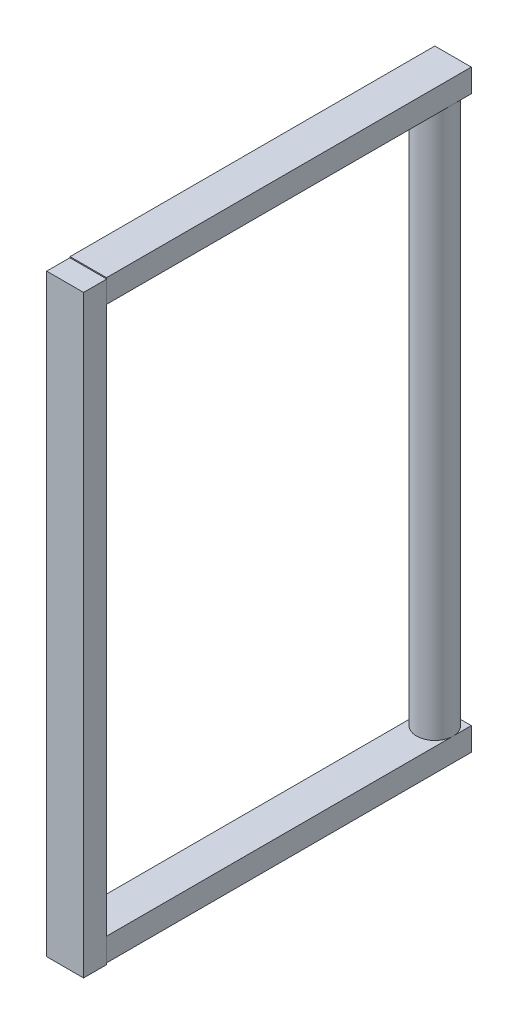
ISO-10303-21;
HEADER;
FILE_DESCRIPTION(('STEP AP214'),'2;1');
FILE_NAME('part.step','',(''),(''),'','','');
FILE_SCHEMA(('AUTOMOTIVE_DESIGN { 1 0 10303 214 1 1 1 1 }'));
ENDSEC;
DATA;
#1=APPLICATION_CONTEXT('core data for automotive mechanical design processes');
#2=APPLICATION_PROTOCOL_DEFINITION('international standard','automotive_design',2000,#1);
#3=PRODUCT_CONTEXT('',#1,'mechanical');
#4=PRODUCT('Part','Part','',(#3));
#5=PRODUCT_RELATED_PRODUCT_CATEGORY('part','',(#4));
#6=PRODUCT_DEFINITION_FORMATION('','',#4);
#7=PRODUCT_DEFINITION_CONTEXT('part definition',#1,'design');
#8=PRODUCT_DEFINITION('design','',#6,#7);
#9=PRODUCT_DEFINITION_SHAPE('','',#8);
#10=(LENGTH_UNIT() NAMED_UNIT(*) SI_UNIT(.MILLI.,.METRE.));
#11=(NAMED_UNIT(*) PLANE_ANGLE_UNIT() SI_UNIT($,.RADIAN.));
#12=(NAMED_UNIT(*) SI_UNIT($,.STERADIAN.) SOLID_ANGLE_UNIT());
#13=UNCERTAINTY_MEASURE_WITH_UNIT(LENGTH_MEASURE(1.E-05),#10,'distance_accuracy_value','');
#14=(GEOMETRIC_REPRESENTATION_CONTEXT(3) GLOBAL_UNCERTAINTY_ASSIGNED_CONTEXT((#13)) GLOBAL_UNIT_ASSIGNED_CONTEXT((#10,
#11,#12)) REPRESENTATION_CONTEXT('',''));
#15=CARTESIAN_POINT('',(0.,0.,0.));
#16=DIRECTION('',(0.,0.,1.));
#17=DIRECTION('',(1.,0.,0.));
#18=AXIS2_PLACEMENT_3D('',#15,#16,#17);
#19=CARTESIAN_POINT('',(-2.,62.54,38.));
#20=DIRECTION('',(0.,0.,-1.));
#21=DIRECTION('',(-1.,0.,0.));
#22=AXIS2_PLACEMENT_3D('',#19,#20,#21);
#23=PLANE('',#22);
#24=DIRECTION('',(-1.,0.,0.));
#25=VECTOR('',#24,1.);
#26=CARTESIAN_POINT('',(-2.02200630574703,62.4195011021442,38.));
#27=LINE('',#26,#25);
#28=CARTESIAN_POINT('',(2.,62.4195011021442,38.));
#29=VERTEX_POINT('',#28);
#30=CARTESIAN_POINT('',(-2.,62.4195011021442,38.));
#31=VERTEX_POINT('',#30);
#32=EDGE_CURVE('E52',#29,#31,#27,.T.);
#33=ORIENTED_EDGE('',*,*,#32,.F.);
#34=DIRECTION('',(0.,-1.,0.));
#35=VECTOR('',#34,1.);
#36=CARTESIAN_POINT('',(2.,62.54,38.));
#37=LINE('',#36,#35);
#38=CARTESIAN_POINT('',(2.,62.54,38.));
#39=VERTEX_POINT('',#38);
#40=EDGE_CURVE('E215',#39,#29,#37,.T.);
#41=ORIENTED_EDGE('',*,*,#40,.F.);
#42=DIRECTION('',(1.,0.,0.));
#43=VECTOR('',#42,1.);
#44=CARTESIAN_POINT('',(-2.,62.54,38.));
#45=LINE('',#44,#43);
#46=CARTESIAN_POINT('',(-2.,62.54,38.));
#47=VERTEX_POINT('',#46);
#48=EDGE_CURVE('E188',#47,#39,#45,.T.);
#49=ORIENTED_EDGE('',*,*,#48,.F.);
#50=DIRECTION('',(0.,-1.,0.));
#51=VECTOR('',#50,1.);
#52=CARTESIAN_POINT('',(-2.,62.54,38.));
#53=LINE('',#52,#51);
#54=EDGE_CURVE('E180',#47,#31,#53,.T.);
#55=ORIENTED_EDGE('',*,*,#54,.T.);
#56=EDGE_LOOP('',(#33,#41,#49,#55));
#57=FACE_BOUND('',#56,.T.);
#58=ADVANCED_FACE('F35',(#57),#23,.F.);
#59=CARTESIAN_POINT('',(0.,60.,0.));
#60=DIRECTION('',(0.,-1.,0.));
#61=DIRECTION('',(0.,0.,-1.));
#62=AXIS2_PLACEMENT_3D('',#59,#60,#61);
#63=CYLINDRICAL_SURFACE('',#62,2.);
#64=CARTESIAN_POINT('',(0.,60.,0.));
#65=DIRECTION('',(0.,1.,0.));
#66=DIRECTION('',(0.,0.,1.));
#67=AXIS2_PLACEMENT_3D('',#64,#65,#66);
#68=CIRCLE('',#67,2.);
#69=CARTESIAN_POINT('',(2.,60.,0.));
#70=VERTEX_POINT('',#69);
#71=CARTESIAN_POINT('',(0.,60.,-2.));
#72=VERTEX_POINT('',#71);
#73=EDGE_CURVE('E11',#70,#72,#68,.T.);
#74=ORIENTED_EDGE('',*,*,#73,.F.);
#75=CARTESIAN_POINT('',(-2.,60.,0.));
#76=VERTEX_POINT('',#75);
#77=EDGE_CURVE('E45',#76,#70,#68,.T.);
#78=ORIENTED_EDGE('',*,*,#77,.F.);
#79=EDGE_CURVE('E44',#72,#76,#68,.T.);
#80=ORIENTED_EDGE('',*,*,#79,.F.);
#81=EDGE_LOOP('',(#74,#78,#80));
#82=FACE_BOUND('',#81,.T.);
#83=CARTESIAN_POINT('',(0.,0.,0.));
#84=DIRECTION('',(0.,1.,0.));
#85=DIRECTION('',(0.,0.,1.));
#86=AXIS2_PLACEMENT_3D('',#83,#84,#85);
#87=CIRCLE('',#86,2.);
#88=CARTESIAN_POINT('',(2.,0.,0.));
#89=VERTEX_POINT('',#88);
#90=CARTESIAN_POINT('',(0.,0.,-2.));
#91=VERTEX_POINT('',#90);
#92=EDGE_CURVE('E39',#89,#91,#87,.T.);
#93=ORIENTED_EDGE('',*,*,#92,.T.);
#94=CARTESIAN_POINT('',(-2.,0.,0.));
#95=VERTEX_POINT('',#94);
#96=EDGE_CURVE('E255',#91,#95,#87,.T.);
#97=ORIENTED_EDGE('',*,*,#96,.T.);
#98=EDGE_CURVE('E250',#95,#89,#87,.T.);
#99=ORIENTED_EDGE('',*,*,#98,.T.);
#100=EDGE_LOOP('',(#93,#97,#99));
#101=FACE_BOUND('',#100,.T.);
#102=ADVANCED_FACE('F37',(#82,#101),#63,.T.);
#103=CARTESIAN_POINT('',(0.,0.,0.));
#104=DIRECTION('',(0.,-1.,0.));
#105=DIRECTION('',(0.,0.,-1.));
#106=AXIS2_PLACEMENT_3D('',#103,#104,#105);
#107=PLANE('',#106);
#108=ORIENTED_EDGE('',*,*,#92,.F.);
#109=DIRECTION('',(0.,0.,1.));
#110=VECTOR('',#109,1.);
#111=CARTESIAN_POINT('',(2.,0.,0.));
#112=LINE('',#111,#110);
#113=CARTESIAN_POINT('',(2.,0.,-2.));
#114=VERTEX_POINT('',#113);
#115=EDGE_CURVE('E230',#114,#89,#112,.T.);
#116=ORIENTED_EDGE('',*,*,#115,.F.);
#117=DIRECTION('',(-1.,0.,0.));
#118=VECTOR('',#117,1.);
#119=CARTESIAN_POINT('',(0.,0.,-2.));
#120=LINE('',#119,#118);
#121=EDGE_CURVE('E221',#114,#91,#120,.T.);
#122=ORIENTED_EDGE('',*,*,#121,.T.);
#123=EDGE_LOOP('',(#108,#116,#122));
#124=FACE_BOUND('',#123,.T.);
#125=ADVANCED_FACE('F284',(#124),#107,.F.);
#126=ORIENTED_EDGE('',*,*,#96,.F.);
#127=CARTESIAN_POINT('',(-2.,0.,-2.));
#128=VERTEX_POINT('',#127);
#129=EDGE_CURVE('E239',#91,#128,#120,.T.);
#130=ORIENTED_EDGE('',*,*,#129,.T.);
#131=DIRECTION('',(0.,0.,1.));
#132=VECTOR('',#131,1.);
#133=CARTESIAN_POINT('',(-2.,0.,0.));
#134=LINE('',#133,#132);
#135=EDGE_CURVE('E236',#128,#95,#134,.T.);
#136=ORIENTED_EDGE('',*,*,#135,.T.);
#137=EDGE_LOOP('',(#126,#130,#136));
#138=FACE_BOUND('',#137,.T.);
#139=ADVANCED_FACE('F289',(#138),#107,.F.);
#140=CARTESIAN_POINT('',(2.,-2.54,0.));
#141=DIRECTION('',(-1.,0.,0.));
#142=DIRECTION('',(0.,0.,1.));
#143=AXIS2_PLACEMENT_3D('',#140,#141,#142);
#144=PLANE('',#143);
#145=ORIENTED_EDGE('',*,*,#115,.T.);
#146=CARTESIAN_POINT('',(2.,0.,38.));
#147=VERTEX_POINT('',#146);
#148=EDGE_CURVE('E217',#89,#147,#112,.T.);
#149=ORIENTED_EDGE('',*,*,#148,.T.);
#150=DIRECTION('',(0.,1.,0.));
#151=VECTOR('',#150,1.);
#152=CARTESIAN_POINT('',(2.,-2.54,38.));
#153=LINE('',#152,#151);
#154=CARTESIAN_POINT('',(2.,-2.54,38.));
#155=VERTEX_POINT('',#154);
#156=EDGE_CURVE('E248',#155,#147,#153,.T.);
#157=ORIENTED_EDGE('',*,*,#156,.F.);
#158=DIRECTION('',(0.,0.,1.));
#159=VECTOR('',#158,1.);
#160=CARTESIAN_POINT('',(2.,-2.54,0.));
#161=LINE('',#160,#159);
#162=CARTESIAN_POINT('',(2.,-2.54,-2.));
#163=VERTEX_POINT('',#162);
#164=EDGE_CURVE('E218',#163,#155,#161,.T.);
#165=ORIENTED_EDGE('',*,*,#164,.F.);
#166=DIRECTION('',(0.,1.,0.));
#167=VECTOR('',#166,1.);
#168=CARTESIAN_POINT('',(2.,-2.54,-2.));
#169=LINE('',#168,#167);
#170=EDGE_CURVE('E229',#163,#114,#169,.T.);
#171=ORIENTED_EDGE('',*,*,#170,.T.);
#172=EDGE_LOOP('',(#145,#149,#157,#165,#171));
#173=FACE_BOUND('',#172,.T.);
#174=ADVANCED_FACE('F314',(#173),#144,.F.);
#175=CARTESIAN_POINT('',(-2.,-2.54,0.));
#176=DIRECTION('',(-1.,0.,0.));
#177=DIRECTION('',(0.,0.,1.));
#178=AXIS2_PLACEMENT_3D('',#175,#176,#177);
#179=PLANE('',#178);
#180=ORIENTED_EDGE('',*,*,#135,.F.);
#181=DIRECTION('',(0.,1.,0.));
#182=VECTOR('',#181,1.);
#183=CARTESIAN_POINT('',(-2.,-2.54,-2.));
#184=LINE('',#183,#182);
#185=CARTESIAN_POINT('',(-2.,-2.54,-2.));
#186=VERTEX_POINT('',#185);
#187=EDGE_CURVE('E243',#186,#128,#184,.T.);
#188=ORIENTED_EDGE('',*,*,#187,.F.);
#189=DIRECTION('',(0.,0.,1.));
#190=VECTOR('',#189,1.);
#191=CARTESIAN_POINT('',(-2.,-2.54,0.));
#192=LINE('',#191,#190);
#193=CARTESIAN_POINT('',(-2.,-2.54,38.));
#194=VERTEX_POINT('',#193);
#195=EDGE_CURVE('E223',#186,#194,#192,.T.);
#196=ORIENTED_EDGE('',*,*,#195,.T.);
#197=DIRECTION('',(0.,1.,0.));
#198=VECTOR('',#197,1.);
#199=CARTESIAN_POINT('',(-2.,-2.54,38.));
#200=LINE('',#199,#198);
#201=CARTESIAN_POINT('',(-2.,0.,38.));
#202=VERTEX_POINT('',#201);
#203=EDGE_CURVE('E246',#194,#202,#200,.T.);
#204=ORIENTED_EDGE('',*,*,#203,.T.);
#205=EDGE_CURVE('E235',#95,#202,#134,.T.);
#206=ORIENTED_EDGE('',*,*,#205,.F.);
#207=EDGE_LOOP('',(#180,#188,#196,#204,#206));
#208=FACE_BOUND('',#207,.T.);
#209=ADVANCED_FACE('F311',(#208),#179,.T.);
#210=CARTESIAN_POINT('',(0.,-2.54,-2.));
#211=DIRECTION('',(0.,0.,-1.));
#212=DIRECTION('',(-1.,0.,0.));
#213=AXIS2_PLACEMENT_3D('',#210,#211,#212);
#214=PLANE('',#213);
#215=ORIENTED_EDGE('',*,*,#121,.F.);
#216=ORIENTED_EDGE('',*,*,#170,.F.);
#217=DIRECTION('',(-1.,0.,0.));
#218=VECTOR('',#217,1.);
#219=CARTESIAN_POINT('',(0.,-2.54,-2.));
#220=LINE('',#219,#218);
#221=EDGE_CURVE('E226',#163,#186,#220,.T.);
#222=ORIENTED_EDGE('',*,*,#221,.T.);
#223=ORIENTED_EDGE('',*,*,#187,.T.);
#224=ORIENTED_EDGE('',*,*,#129,.F.);
#225=EDGE_LOOP('',(#215,#216,#222,#223,#224));
#226=FACE_BOUND('',#225,.T.);
#227=ADVANCED_FACE('F304',(#226),#214,.T.);
#228=CARTESIAN_POINT('',(0.,-2.54,0.));
#229=DIRECTION('',(0.,-1.,0.));
#230=DIRECTION('',(0.,0.,-1.));
#231=AXIS2_PLACEMENT_3D('',#228,#229,#230);
#232=PLANE('',#231);
#233=ORIENTED_EDGE('',*,*,#164,.T.);
#234=DIRECTION('',(-1.,0.,0.));
#235=VECTOR('',#234,1.);
#236=CARTESIAN_POINT('',(0.,-2.54,38.));
#237=LINE('',#236,#235);
#238=EDGE_CURVE('E220',#155,#194,#237,.T.);
#239=ORIENTED_EDGE('',*,*,#238,.T.);
#240=ORIENTED_EDGE('',*,*,#195,.F.);
#241=ORIENTED_EDGE('',*,*,#221,.F.);
#242=EDGE_LOOP('',(#233,#239,#240,#241));
#243=FACE_BOUND('',#242,.T.);
#244=ADVANCED_FACE('F302',(#243),#232,.T.);
#245=ORIENTED_EDGE('',*,*,#98,.F.);
#246=ORIENTED_EDGE('',*,*,#205,.T.);
#247=DIRECTION('',(-1.,0.,0.));
#248=VECTOR('',#247,1.);
#249=CARTESIAN_POINT('',(0.,0.,38.));
#250=LINE('',#249,#248);
#251=EDGE_CURVE('E232',#147,#202,#250,.T.);
#252=ORIENTED_EDGE('',*,*,#251,.F.);
#253=ORIENTED_EDGE('',*,*,#148,.F.);
#254=EDGE_LOOP('',(#245,#246,#252,#253));
#255=FACE_BOUND('',#254,.T.);
#256=ADVANCED_FACE('F292',(#255),#107,.F.);
#257=CARTESIAN_POINT('',(0.,60.,0.));
#258=DIRECTION('',(0.,1.,0.));
#259=DIRECTION('',(0.,0.,1.));
#260=AXIS2_PLACEMENT_3D('',#257,#258,#259);
#261=PLANE('',#260);
#262=DIRECTION('',(0.,0.,-1.));
#263=VECTOR('',#262,1.);
#264=CARTESIAN_POINT('',(2.,60.,-2.));
#265=LINE('',#264,#263);
#266=CARTESIAN_POINT('',(2.,60.,-2.));
#267=VERTEX_POINT('',#266);
#268=EDGE_CURVE('E203',#70,#267,#265,.T.);
#269=ORIENTED_EDGE('',*,*,#268,.F.);
#270=ORIENTED_EDGE('',*,*,#73,.T.);
#271=DIRECTION('',(-1.,0.,0.));
#272=VECTOR('',#271,1.);
#273=CARTESIAN_POINT('',(-2.,60.,-2.));
#274=LINE('',#273,#272);
#275=EDGE_CURVE('E189',#267,#72,#274,.T.);
#276=ORIENTED_EDGE('',*,*,#275,.F.);
#277=EDGE_LOOP('',(#269,#270,#276));
#278=FACE_BOUND('',#277,.T.);
#279=ADVANCED_FACE('F282',(#278),#261,.F.);
#280=CARTESIAN_POINT('',(-2.,60.,-2.));
#281=VERTEX_POINT('',#280);
#282=EDGE_CURVE('E207',#72,#281,#274,.T.);
#283=ORIENTED_EDGE('',*,*,#282,.F.);
#284=ORIENTED_EDGE('',*,*,#79,.T.);
#285=DIRECTION('',(0.,0.,1.));
#286=VECTOR('',#285,1.);
#287=CARTESIAN_POINT('',(-2.,60.,-2.));
#288=LINE('',#287,#286);
#289=EDGE_CURVE('E196',#281,#76,#288,.T.);
#290=ORIENTED_EDGE('',*,*,#289,.F.);
#291=EDGE_LOOP('',(#283,#284,#290));
#292=FACE_BOUND('',#291,.T.);
#293=ADVANCED_FACE('F267',(#292),#261,.F.);
#294=CARTESIAN_POINT('',(-2.,60.,38.));
#295=VERTEX_POINT('',#294);
#296=EDGE_CURVE('E200',#76,#295,#288,.T.);
#297=ORIENTED_EDGE('',*,*,#296,.F.);
#298=ORIENTED_EDGE('',*,*,#77,.T.);
#299=CARTESIAN_POINT('',(2.,60.,38.));
#300=VERTEX_POINT('',#299);
#301=EDGE_CURVE('E204',#300,#70,#265,.T.);
#302=ORIENTED_EDGE('',*,*,#301,.F.);
#303=DIRECTION('',(1.,0.,0.));
#304=VECTOR('',#303,1.);
#305=CARTESIAN_POINT('',(-2.,60.,38.));
#306=LINE('',#305,#304);
#307=EDGE_CURVE('E199',#295,#300,#306,.T.);
#308=ORIENTED_EDGE('',*,*,#307,.F.);
#309=EDGE_LOOP('',(#297,#298,#302,#308));
#310=FACE_BOUND('',#309,.T.);
#311=ADVANCED_FACE('F269',(#310),#261,.F.);
#312=CARTESIAN_POINT('',(-2.,62.54,-2.));
#313=DIRECTION('',(1.,0.,0.));
#314=DIRECTION('',(0.,0.,-1.));
#315=AXIS2_PLACEMENT_3D('',#312,#313,#314);
#316=PLANE('',#315);
#317=ORIENTED_EDGE('',*,*,#289,.T.);
#318=ORIENTED_EDGE('',*,*,#296,.T.);
#319=EDGE_CURVE('E175',#31,#295,#53,.T.);
#320=ORIENTED_EDGE('',*,*,#319,.F.);
#321=ORIENTED_EDGE('',*,*,#54,.F.);
#322=DIRECTION('',(0.,0.,1.));
#323=VECTOR('',#322,1.);
#324=CARTESIAN_POINT('',(-2.,62.54,-2.));
#325=LINE('',#324,#323);
#326=CARTESIAN_POINT('',(-2.,62.54,-2.));
#327=VERTEX_POINT('',#326);
#328=EDGE_CURVE('E185',#327,#47,#325,.T.);
#329=ORIENTED_EDGE('',*,*,#328,.F.);
#330=DIRECTION('',(0.,-1.,0.));
#331=VECTOR('',#330,1.);
#332=CARTESIAN_POINT('',(-2.,62.54,-2.));
#333=LINE('',#332,#331);
#334=EDGE_CURVE('E195',#327,#281,#333,.T.);
#335=ORIENTED_EDGE('',*,*,#334,.T.);
#336=EDGE_LOOP('',(#317,#318,#320,#321,#329,#335));
#337=FACE_BOUND('',#336,.T.);
#338=ADVANCED_FACE('F272',(#337),#316,.F.);
#339=CARTESIAN_POINT('',(2.,62.54,-2.));
#340=DIRECTION('',(-1.,0.,0.));
#341=DIRECTION('',(0.,0.,1.));
#342=AXIS2_PLACEMENT_3D('',#339,#340,#341);
#343=PLANE('',#342);
#344=ORIENTED_EDGE('',*,*,#301,.T.);
#345=ORIENTED_EDGE('',*,*,#268,.T.);
#346=DIRECTION('',(0.,-1.,0.));
#347=VECTOR('',#346,1.);
#348=CARTESIAN_POINT('',(2.,62.54,-2.));
#349=LINE('',#348,#347);
#350=CARTESIAN_POINT('',(2.,62.54,-2.));
#351=VERTEX_POINT('',#350);
#352=EDGE_CURVE('E212',#351,#267,#349,.T.);
#353=ORIENTED_EDGE('',*,*,#352,.F.);
#354=DIRECTION('',(0.,0.,-1.));
#355=VECTOR('',#354,1.);
#356=CARTESIAN_POINT('',(2.,62.54,-2.));
#357=LINE('',#356,#355);
#358=EDGE_CURVE('E191',#39,#351,#357,.T.);
#359=ORIENTED_EDGE('',*,*,#358,.F.);
#360=ORIENTED_EDGE('',*,*,#40,.T.);
#361=EDGE_CURVE('E178',#29,#300,#37,.T.);
#362=ORIENTED_EDGE('',*,*,#361,.T.);
#363=EDGE_LOOP('',(#344,#345,#353,#359,#360,#362));
#364=FACE_BOUND('',#363,.T.);
#365=ADVANCED_FACE('F298',(#364),#343,.F.);
#366=CARTESIAN_POINT('',(-2.,62.54,-2.));
#367=DIRECTION('',(0.,0.,1.));
#368=DIRECTION('',(1.,0.,0.));
#369=AXIS2_PLACEMENT_3D('',#366,#367,#368);
#370=PLANE('',#369);
#371=ORIENTED_EDGE('',*,*,#275,.T.);
#372=ORIENTED_EDGE('',*,*,#282,.T.);
#373=ORIENTED_EDGE('',*,*,#334,.F.);
#374=DIRECTION('',(-1.,0.,0.));
#375=VECTOR('',#374,1.);
#376=CARTESIAN_POINT('',(-2.,62.54,-2.));
#377=LINE('',#376,#375);
#378=EDGE_CURVE('E193',#351,#327,#377,.T.);
#379=ORIENTED_EDGE('',*,*,#378,.F.);
#380=ORIENTED_EDGE('',*,*,#352,.T.);
#381=EDGE_LOOP('',(#371,#372,#373,#379,#380));
#382=FACE_BOUND('',#381,.T.);
#383=ADVANCED_FACE('F278',(#382),#370,.F.);
#384=CARTESIAN_POINT('',(0.,62.54,0.));
#385=DIRECTION('',(0.,1.,0.));
#386=DIRECTION('',(0.,0.,1.));
#387=AXIS2_PLACEMENT_3D('',#384,#385,#386);
#388=PLANE('',#387);
#389=ORIENTED_EDGE('',*,*,#328,.T.);
#390=ORIENTED_EDGE('',*,*,#48,.T.);
#391=ORIENTED_EDGE('',*,*,#358,.T.);
#392=ORIENTED_EDGE('',*,*,#378,.T.);
#393=EDGE_LOOP('',(#389,#390,#391,#392));
#394=FACE_BOUND('',#393,.T.);
#395=ADVANCED_FACE('F356',(#394),#388,.T.);
#396=CARTESIAN_POINT('',(-2.02200630574703,62.4195011021442,40.54));
#397=DIRECTION('',(1.,0.,0.));
#398=DIRECTION('',(0.,0.,-1.));
#399=AXIS2_PLACEMENT_3D('',#396,#397,#398);
#400=PLANE('',#399);
#401=DIRECTION('',(0.,-1.,0.));
#402=VECTOR('',#401,1.);
#403=CARTESIAN_POINT('',(-2.02200630574703,62.4195011021442,38.));
#404=LINE('',#403,#402);
#405=CARTESIAN_POINT('',(-2.02200630574703,62.4195011021442,38.));
#406=VERTEX_POINT('',#405);
#407=CARTESIAN_POINT('',(-2.02200630574703,-2.68910194291021,38.));
#408=VERTEX_POINT('',#407);
#409=EDGE_CURVE('E174',#406,#408,#404,.T.);
#410=ORIENTED_EDGE('',*,*,#409,.T.);
#411=DIRECTION('',(0.,0.,-1.));
#412=VECTOR('',#411,1.);
#413=CARTESIAN_POINT('',(-2.02200630574703,-2.68910194291021,40.54));
#414=LINE('',#413,#412);
#415=CARTESIAN_POINT('',(-2.02200630574703,-2.68910194291021,40.54));
#416=VERTEX_POINT('',#415);
#417=EDGE_CURVE('E154',#416,#408,#414,.T.);
#418=ORIENTED_EDGE('',*,*,#417,.F.);
#419=DIRECTION('',(0.,-1.,0.));
#420=VECTOR('',#419,1.);
#421=CARTESIAN_POINT('',(-2.02200630574703,62.4195011021442,40.54));
#422=LINE('',#421,#420);
#423=CARTESIAN_POINT('',(-2.02200630574703,62.4195011021442,40.54));
#424=VERTEX_POINT('',#423);
#425=EDGE_CURVE('E161',#424,#416,#422,.T.);
#426=ORIENTED_EDGE('',*,*,#425,.F.);
#427=DIRECTION('',(0.,0.,-1.));
#428=VECTOR('',#427,1.);
#429=CARTESIAN_POINT('',(-2.02200630574703,62.4195011021442,40.54));
#430=LINE('',#429,#428);
#431=EDGE_CURVE('E379',#424,#406,#430,.T.);
#432=ORIENTED_EDGE('',*,*,#431,.T.);
#433=EDGE_LOOP('',(#410,#418,#426,#432));
#434=FACE_BOUND('',#433,.T.);
#435=ADVANCED_FACE('F172',(#434),#400,.F.);
#436=CARTESIAN_POINT('',(-2.02200630574703,-2.68910194291021,40.54));
#437=DIRECTION('',(0.,1.,0.));
#438=DIRECTION('',(0.,0.,1.));
#439=AXIS2_PLACEMENT_3D('',#436,#437,#438);
#440=PLANE('',#439);
#441=DIRECTION('',(1.,0.,0.));
#442=VECTOR('',#441,1.);
#443=CARTESIAN_POINT('',(-2.02200630574703,-2.68910194291021,38.));
#444=LINE('',#443,#442);
#445=CARTESIAN_POINT('',(2.02200630574703,-2.68910194291021,38.));
#446=VERTEX_POINT('',#445);
#447=EDGE_CURVE('E382',#408,#446,#444,.T.);
#448=ORIENTED_EDGE('',*,*,#447,.T.);
#449=DIRECTION('',(0.,0.,-1.));
#450=VECTOR('',#449,1.);
#451=CARTESIAN_POINT('',(2.02200630574703,-2.68910194291021,40.54));
#452=LINE('',#451,#450);
#453=CARTESIAN_POINT('',(2.02200630574703,-2.68910194291021,40.54));
#454=VERTEX_POINT('',#453);
#455=EDGE_CURVE('E157',#454,#446,#452,.T.);
#456=ORIENTED_EDGE('',*,*,#455,.F.);
#457=DIRECTION('',(1.,0.,0.));
#458=VECTOR('',#457,1.);
#459=CARTESIAN_POINT('',(-2.02200630574703,-2.68910194291021,40.54));
#460=LINE('',#459,#458);
#461=EDGE_CURVE('E150',#416,#454,#460,.T.);
#462=ORIENTED_EDGE('',*,*,#461,.F.);
#463=ORIENTED_EDGE('',*,*,#417,.T.);
#464=EDGE_LOOP('',(#448,#456,#462,#463));
#465=FACE_BOUND('',#464,.T.);
#466=ADVANCED_FACE('F152',(#465),#440,.F.);
#467=CARTESIAN_POINT('',(2.02200630574703,62.4195011021442,40.54));
#468=DIRECTION('',(-1.,0.,0.));
#469=DIRECTION('',(0.,0.,1.));
#470=AXIS2_PLACEMENT_3D('',#467,#468,#469);
#471=PLANE('',#470);
#472=DIRECTION('',(0.,1.,0.));
#473=VECTOR('',#472,1.);
#474=CARTESIAN_POINT('',(2.02200630574703,62.4195011021442,38.));
#475=LINE('',#474,#473);
#476=CARTESIAN_POINT('',(2.02200630574703,62.4195011021442,38.));
#477=VERTEX_POINT('',#476);
#478=EDGE_CURVE('E373',#446,#477,#475,.T.);
#479=ORIENTED_EDGE('',*,*,#478,.T.);
#480=DIRECTION('',(0.,0.,-1.));
#481=VECTOR('',#480,1.);
#482=CARTESIAN_POINT('',(2.02200630574703,62.4195011021442,40.54));
#483=LINE('',#482,#481);
#484=CARTESIAN_POINT('',(2.02200630574703,62.4195011021442,40.54));
#485=VERTEX_POINT('',#484);
#486=EDGE_CURVE('E181',#485,#477,#483,.T.);
#487=ORIENTED_EDGE('',*,*,#486,.F.);
#488=DIRECTION('',(0.,1.,0.));
#489=VECTOR('',#488,1.);
#490=CARTESIAN_POINT('',(2.02200630574703,62.4195011021442,40.54));
#491=LINE('',#490,#489);
#492=EDGE_CURVE('E160',#454,#485,#491,.T.);
#493=ORIENTED_EDGE('',*,*,#492,.F.);
#494=ORIENTED_EDGE('',*,*,#455,.T.);
#495=EDGE_LOOP('',(#479,#487,#493,#494));
#496=FACE_BOUND('',#495,.T.);
#497=ADVANCED_FACE('F347',(#496),#471,.F.);
#498=CARTESIAN_POINT('',(-2.02200630574703,62.4195011021442,40.54));
#499=DIRECTION('',(0.,-1.,0.));
#500=DIRECTION('',(0.,0.,-1.));
#501=AXIS2_PLACEMENT_3D('',#498,#499,#500);
#502=PLANE('',#501);
#503=EDGE_CURVE('E170',#477,#29,#27,.T.);
#504=ORIENTED_EDGE('',*,*,#503,.T.);
#505=ORIENTED_EDGE('',*,*,#32,.T.);
#506=EDGE_CURVE('E371',#31,#406,#27,.T.);
#507=ORIENTED_EDGE('',*,*,#506,.T.);
#508=ORIENTED_EDGE('',*,*,#431,.F.);
#509=DIRECTION('',(-1.,0.,0.));
#510=VECTOR('',#509,1.);
#511=CARTESIAN_POINT('',(-2.02200630574703,62.4195011021442,40.54));
#512=LINE('',#511,#510);
#513=EDGE_CURVE('E166',#485,#424,#512,.T.);
#514=ORIENTED_EDGE('',*,*,#513,.F.);
#515=ORIENTED_EDGE('',*,*,#486,.T.);
#516=EDGE_LOOP('',(#504,#505,#507,#508,#514,#515));
#517=FACE_BOUND('',#516,.T.);
#518=ADVANCED_FACE('F341',(#517),#502,.F.);
#519=CARTESIAN_POINT('',(0.,0.,40.54));
#520=DIRECTION('',(0.,0.,1.));
#521=DIRECTION('',(1.,0.,0.));
#522=AXIS2_PLACEMENT_3D('',#519,#520,#521);
#523=PLANE('',#522);
#524=ORIENTED_EDGE('',*,*,#425,.T.);
#525=ORIENTED_EDGE('',*,*,#461,.T.);
#526=ORIENTED_EDGE('',*,*,#492,.T.);
#527=ORIENTED_EDGE('',*,*,#513,.T.);
#528=EDGE_LOOP('',(#524,#525,#526,#527));
#529=FACE_BOUND('',#528,.T.);
#530=ADVANCED_FACE('F164',(#529),#523,.T.);
#531=CARTESIAN_POINT('',(0.,0.,38.));
#532=DIRECTION('',(0.,0.,1.));
#533=DIRECTION('',(1.,0.,0.));
#534=AXIS2_PLACEMENT_3D('',#531,#532,#533);
#535=PLANE('',#534);
#536=ORIENTED_EDGE('',*,*,#361,.F.);
#537=ORIENTED_EDGE('',*,*,#503,.F.);
#538=ORIENTED_EDGE('',*,*,#478,.F.);
#539=ORIENTED_EDGE('',*,*,#447,.F.);
#540=ORIENTED_EDGE('',*,*,#409,.F.);
#541=ORIENTED_EDGE('',*,*,#506,.F.);
#542=ORIENTED_EDGE('',*,*,#319,.T.);
#543=ORIENTED_EDGE('',*,*,#307,.T.);
#544=EDGE_LOOP('',(#536,#537,#538,#539,#540,#541,#542,#543));
#545=FACE_BOUND('',#544,.T.);
#546=ORIENTED_EDGE('',*,*,#238,.F.);
#547=ORIENTED_EDGE('',*,*,#156,.T.);
#548=ORIENTED_EDGE('',*,*,#251,.T.);
#549=ORIENTED_EDGE('',*,*,#203,.F.);
#550=EDGE_LOOP('',(#546,#547,#548,#549));
#551=FACE_BOUND('',#550,.T.);
#552=ADVANCED_FACE('F333',(#545,#551),#535,.F.);
#553=CLOSED_SHELL('',(#58,#102,#125,#139,#174,#209,#227,#244,#256,#279,#293,#311,#338,#365,#383,
#395,#435,#466,#497,#518,#530,#552));
#554=MANIFOLD_SOLID_BREP('B2',#553);
#555=ADVANCED_BREP_SHAPE_REPRESENTATION('',(#18,#554),#14);
#556=SHAPE_DEFINITION_REPRESENTATION(#9,#555);
ENDSEC;
END-ISO-10303-21;
